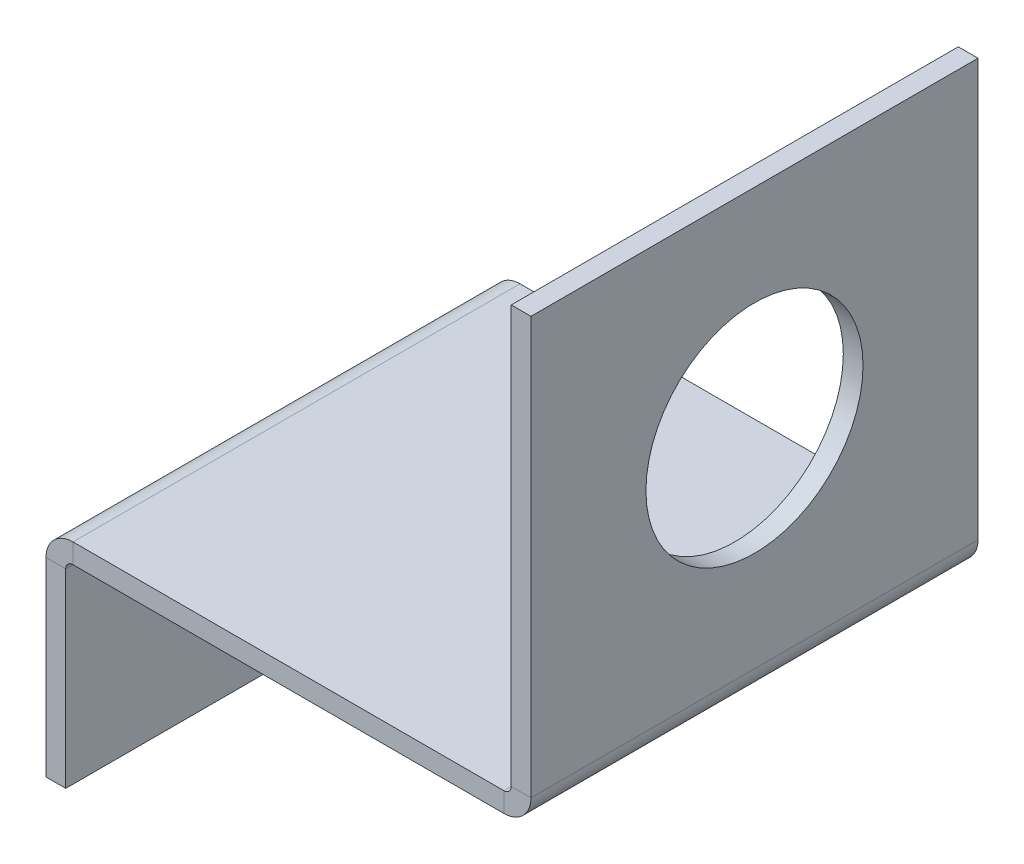
ISO-10303-21;
HEADER;
FILE_DESCRIPTION(('STEP AP214'),'2;1');
FILE_NAME('part.step','',(''),(''),'','','');
FILE_SCHEMA(('AUTOMOTIVE_DESIGN { 1 0 10303 214 1 1 1 1 }'));
ENDSEC;
DATA;
#1=APPLICATION_CONTEXT('core data for automotive mechanical design processes');
#2=APPLICATION_PROTOCOL_DEFINITION('international standard','automotive_design',2000,#1);
#3=PRODUCT_CONTEXT('',#1,'mechanical');
#4=PRODUCT('Part','Part','',(#3));
#5=PRODUCT_RELATED_PRODUCT_CATEGORY('part','',(#4));
#6=PRODUCT_DEFINITION_FORMATION('','',#4);
#7=PRODUCT_DEFINITION_CONTEXT('part definition',#1,'design');
#8=PRODUCT_DEFINITION('design','',#6,#7);
#9=PRODUCT_DEFINITION_SHAPE('','',#8);
#10=(LENGTH_UNIT() NAMED_UNIT(*) SI_UNIT(.MILLI.,.METRE.));
#11=(NAMED_UNIT(*) PLANE_ANGLE_UNIT() SI_UNIT($,.RADIAN.));
#12=(NAMED_UNIT(*) SI_UNIT($,.STERADIAN.) SOLID_ANGLE_UNIT());
#13=UNCERTAINTY_MEASURE_WITH_UNIT(LENGTH_MEASURE(1.E-05),#10,'distance_accuracy_value','');
#14=(GEOMETRIC_REPRESENTATION_CONTEXT(3) GLOBAL_UNCERTAINTY_ASSIGNED_CONTEXT((#13)) GLOBAL_UNIT_ASSIGNED_CONTEXT((#10,
#11,#12)) REPRESENTATION_CONTEXT('',''));
#15=CARTESIAN_POINT('',(0.,0.,0.));
#16=DIRECTION('',(0.,0.,1.));
#17=DIRECTION('',(1.,0.,0.));
#18=AXIS2_PLACEMENT_3D('',#15,#16,#17);
#19=CARTESIAN_POINT('',(0.,0.,-45.3));
#20=DIRECTION('',(0.,0.,1.));
#21=DIRECTION('',(1.,0.,0.));
#22=AXIS2_PLACEMENT_3D('',#19,#20,#21);
#23=PLANE('',#22);
#24=DIRECTION('',(0.,-1.,0.));
#25=VECTOR('',#24,1.);
#26=CARTESIAN_POINT('',(44.4071912642045,1.59594559789866E-13,-45.3));
#27=LINE('',#26,#25);
#28=CARTESIAN_POINT('',(44.4071912642045,1.59594559789866E-13,-45.3));
#29=VERTEX_POINT('',#28);
#30=CARTESIAN_POINT('',(44.4071912642045,-1.99999999999984,-45.3));
#31=VERTEX_POINT('',#30);
#32=EDGE_CURVE('E217',#29,#31,#27,.T.);
#33=ORIENTED_EDGE('',*,*,#32,.T.);
#34=DIRECTION('',(1.,0.,0.));
#35=VECTOR('',#34,1.);
#36=CARTESIAN_POINT('',(0.,-2.,-45.3));
#37=LINE('',#36,#35);
#38=CARTESIAN_POINT('',(0.736599999999997,-2.,-45.3));
#39=VERTEX_POINT('',#38);
#40=EDGE_CURVE('E242',#31,#39,#37,.F.);
#41=ORIENTED_EDGE('',*,*,#40,.T.);
#42=DIRECTION('',(0.,-1.,0.));
#43=VECTOR('',#42,1.);
#44=CARTESIAN_POINT('',(0.73659999999999,0.,-45.3));
#45=LINE('',#44,#43);
#46=CARTESIAN_POINT('',(0.73659999999999,0.,-45.3));
#47=VERTEX_POINT('',#46);
#48=EDGE_CURVE('E230',#39,#47,#45,.F.);
#49=ORIENTED_EDGE('',*,*,#48,.T.);
#50=DIRECTION('',(-1.,0.,0.));
#51=VECTOR('',#50,1.);
#52=CARTESIAN_POINT('',(0.,0.,-45.3));
#53=LINE('',#52,#51);
#54=EDGE_CURVE('E237',#29,#47,#53,.T.);
#55=ORIENTED_EDGE('',*,*,#54,.F.);
#56=EDGE_LOOP('',(#33,#41,#49,#55));
#57=FACE_BOUND('',#56,.T.);
#58=ADVANCED_FACE('F79',(#57),#23,.F.);
#59=CARTESIAN_POINT('',(47.1437912642045,1.64798730217797E-13,0.));
#60=DIRECTION('',(0.,0.,-1.));
#61=DIRECTION('',(-1.,0.,0.));
#62=AXIS2_PLACEMENT_3D('',#59,#60,#61);
#63=PLANE('',#62);
#64=DIRECTION('',(0.,-1.,0.));
#65=VECTOR('',#64,1.);
#66=CARTESIAN_POINT('',(44.4071912642045,1.59594559789866E-13,0.));
#67=LINE('',#66,#65);
#68=CARTESIAN_POINT('',(44.4071912642045,1.59594559789866E-13,0.));
#69=VERTEX_POINT('',#68);
#70=CARTESIAN_POINT('',(44.4071912642045,-1.99999999999984,0.));
#71=VERTEX_POINT('',#70);
#72=EDGE_CURVE('E228',#69,#71,#67,.T.);
#73=ORIENTED_EDGE('',*,*,#72,.F.);
#74=DIRECTION('',(1.,0.,0.));
#75=VECTOR('',#74,1.);
#76=CARTESIAN_POINT('',(0.,0.,0.));
#77=LINE('',#76,#75);
#78=CARTESIAN_POINT('',(0.73659999999999,0.,0.));
#79=VERTEX_POINT('',#78);
#80=EDGE_CURVE('E233',#79,#69,#77,.T.);
#81=ORIENTED_EDGE('',*,*,#80,.F.);
#82=DIRECTION('',(0.,-1.,0.));
#83=VECTOR('',#82,1.);
#84=CARTESIAN_POINT('',(0.736599999999997,-2.,0.));
#85=LINE('',#84,#83);
#86=CARTESIAN_POINT('',(0.736599999999997,-2.,0.));
#87=VERTEX_POINT('',#86);
#88=EDGE_CURVE('E247',#87,#79,#85,.F.);
#89=ORIENTED_EDGE('',*,*,#88,.F.);
#90=DIRECTION('',(-1.,0.,0.));
#91=VECTOR('',#90,1.);
#92=CARTESIAN_POINT('',(47.1437912642045,-1.99999999999984,0.));
#93=LINE('',#92,#91);
#94=EDGE_CURVE('E239',#87,#71,#93,.F.);
#95=ORIENTED_EDGE('',*,*,#94,.T.);
#96=EDGE_LOOP('',(#73,#81,#89,#95));
#97=FACE_BOUND('',#96,.T.);
#98=ADVANCED_FACE('F321',(#97),#63,.F.);
#99=CARTESIAN_POINT('',(0.,0.,0.));
#100=DIRECTION('',(0.,-1.,0.));
#101=DIRECTION('',(1.,0.,0.));
#102=AXIS2_PLACEMENT_3D('',#99,#100,#101);
#103=PLANE('',#102);
#104=DIRECTION('',(0.,0.,-1.));
#105=VECTOR('',#104,1.);
#106=CARTESIAN_POINT('',(44.4071912642045,1.59594559789866E-13,-45.3));
#107=LINE('',#106,#105);
#108=EDGE_CURVE('E223',#29,#69,#107,.F.);
#109=ORIENTED_EDGE('',*,*,#108,.F.);
#110=ORIENTED_EDGE('',*,*,#54,.T.);
#111=DIRECTION('',(0.,0.,1.));
#112=VECTOR('',#111,1.);
#113=CARTESIAN_POINT('',(0.73659999999999,0.,-45.3));
#114=LINE('',#113,#112);
#115=EDGE_CURVE('E244',#79,#47,#114,.F.);
#116=ORIENTED_EDGE('',*,*,#115,.F.);
#117=ORIENTED_EDGE('',*,*,#80,.T.);
#118=EDGE_LOOP('',(#109,#110,#116,#117));
#119=FACE_BOUND('',#118,.T.);
#120=ADVANCED_FACE('F324',(#119),#103,.F.);
#121=CARTESIAN_POINT('',(0.,-2.,0.));
#122=DIRECTION('',(0.,-1.,0.));
#123=DIRECTION('',(1.,0.,0.));
#124=AXIS2_PLACEMENT_3D('',#121,#122,#123);
#125=PLANE('',#124);
#126=ORIENTED_EDGE('',*,*,#40,.F.);
#127=DIRECTION('',(0.,0.,-1.));
#128=VECTOR('',#127,1.);
#129=CARTESIAN_POINT('',(44.4071912642045,-1.99999999999984,-45.3));
#130=LINE('',#129,#128);
#131=EDGE_CURVE('E212',#31,#71,#130,.F.);
#132=ORIENTED_EDGE('',*,*,#131,.T.);
#133=ORIENTED_EDGE('',*,*,#94,.F.);
#134=DIRECTION('',(0.,0.,1.));
#135=VECTOR('',#134,1.);
#136=CARTESIAN_POINT('',(0.736599999999997,-2.,-45.3));
#137=LINE('',#136,#135);
#138=EDGE_CURVE('E250',#39,#87,#137,.T.);
#139=ORIENTED_EDGE('',*,*,#138,.F.);
#140=EDGE_LOOP('',(#126,#132,#133,#139));
#141=FACE_BOUND('',#140,.T.);
#142=ADVANCED_FACE('F312',(#141),#125,.T.);
#143=CARTESIAN_POINT('',(-2.,0.,0.));
#144=DIRECTION('',(0.,0.,1.));
#145=DIRECTION('',(0.,-1.,0.));
#146=AXIS2_PLACEMENT_3D('',#143,#144,#145);
#147=PLANE('',#146);
#148=DIRECTION('',(0.,-1.,0.));
#149=VECTOR('',#148,1.);
#150=CARTESIAN_POINT('',(0.,0.,0.));
#151=LINE('',#150,#149);
#152=CARTESIAN_POINT('',(0.,-2.7366,0.));
#153=VERTEX_POINT('',#152);
#154=CARTESIAN_POINT('',(0.,-22.,0.));
#155=VERTEX_POINT('',#154);
#156=EDGE_CURVE('E272',#153,#155,#151,.T.);
#157=ORIENTED_EDGE('',*,*,#156,.F.);
#158=DIRECTION('',(-1.,0.,0.));
#159=VECTOR('',#158,1.);
#160=CARTESIAN_POINT('',(0.,-2.7366,0.));
#161=LINE('',#160,#159);
#162=CARTESIAN_POINT('',(-2.,-2.7366,0.));
#163=VERTEX_POINT('',#162);
#164=EDGE_CURVE('E260',#153,#163,#161,.T.);
#165=ORIENTED_EDGE('',*,*,#164,.T.);
#166=DIRECTION('',(0.,-1.,0.));
#167=VECTOR('',#166,1.);
#168=CARTESIAN_POINT('',(-2.,0.,0.));
#169=LINE('',#168,#167);
#170=CARTESIAN_POINT('',(-2.,-22.,0.));
#171=VERTEX_POINT('',#170);
#172=EDGE_CURVE('E275',#163,#171,#169,.T.);
#173=ORIENTED_EDGE('',*,*,#172,.T.);
#174=DIRECTION('',(1.,0.,0.));
#175=VECTOR('',#174,1.);
#176=CARTESIAN_POINT('',(-2.,-22.,0.));
#177=LINE('',#176,#175);
#178=EDGE_CURVE('E88',#171,#155,#177,.T.);
#179=ORIENTED_EDGE('',*,*,#178,.T.);
#180=EDGE_LOOP('',(#157,#165,#173,#179));
#181=FACE_BOUND('',#180,.T.);
#182=ADVANCED_FACE('F81',(#181),#147,.T.);
#183=CARTESIAN_POINT('',(-2.,0.,0.));
#184=DIRECTION('',(1.,0.,0.));
#185=DIRECTION('',(0.,0.,-1.));
#186=AXIS2_PLACEMENT_3D('',#183,#184,#185);
#187=PLANE('',#186);
#188=DIRECTION('',(0.,0.,1.));
#189=VECTOR('',#188,1.);
#190=CARTESIAN_POINT('',(-2.,-2.7366,0.));
#191=LINE('',#190,#189);
#192=CARTESIAN_POINT('',(-2.,-2.7366,-45.3));
#193=VERTEX_POINT('',#192);
#194=EDGE_CURVE('E254',#163,#193,#191,.F.);
#195=ORIENTED_EDGE('',*,*,#194,.T.);
#196=DIRECTION('',(0.,1.,0.));
#197=VECTOR('',#196,1.);
#198=CARTESIAN_POINT('',(-2.,0.,-45.3));
#199=LINE('',#198,#197);
#200=CARTESIAN_POINT('',(-2.,-22.,-45.3));
#201=VERTEX_POINT('',#200);
#202=EDGE_CURVE('E281',#201,#193,#199,.T.);
#203=ORIENTED_EDGE('',*,*,#202,.F.);
#204=DIRECTION('',(0.,0.,-1.));
#205=VECTOR('',#204,1.);
#206=CARTESIAN_POINT('',(-2.,-22.,0.));
#207=LINE('',#206,#205);
#208=EDGE_CURVE('E277',#171,#201,#207,.T.);
#209=ORIENTED_EDGE('',*,*,#208,.F.);
#210=ORIENTED_EDGE('',*,*,#172,.F.);
#211=EDGE_LOOP('',(#195,#203,#209,#210));
#212=FACE_BOUND('',#211,.T.);
#213=ADVANCED_FACE('F330',(#212),#187,.F.);
#214=CARTESIAN_POINT('',(0.,0.,0.));
#215=DIRECTION('',(1.,0.,0.));
#216=DIRECTION('',(0.,0.,-1.));
#217=AXIS2_PLACEMENT_3D('',#214,#215,#216);
#218=PLANE('',#217);
#219=DIRECTION('',(0.,1.,0.));
#220=VECTOR('',#219,1.);
#221=CARTESIAN_POINT('',(0.,0.,-45.3));
#222=LINE('',#221,#220);
#223=CARTESIAN_POINT('',(0.,-22.,-45.3));
#224=VERTEX_POINT('',#223);
#225=CARTESIAN_POINT('',(0.,-2.7366,-45.3));
#226=VERTEX_POINT('',#225);
#227=EDGE_CURVE('E278',#224,#226,#222,.T.);
#228=ORIENTED_EDGE('',*,*,#227,.T.);
#229=DIRECTION('',(0.,0.,1.));
#230=VECTOR('',#229,1.);
#231=CARTESIAN_POINT('',(0.,-2.7366,0.));
#232=LINE('',#231,#230);
#233=EDGE_CURVE('E104',#153,#226,#232,.F.);
#234=ORIENTED_EDGE('',*,*,#233,.F.);
#235=ORIENTED_EDGE('',*,*,#156,.T.);
#236=DIRECTION('',(0.,0.,-1.));
#237=VECTOR('',#236,1.);
#238=CARTESIAN_POINT('',(0.,-22.,0.));
#239=LINE('',#238,#237);
#240=EDGE_CURVE('E285',#155,#224,#239,.T.);
#241=ORIENTED_EDGE('',*,*,#240,.T.);
#242=EDGE_LOOP('',(#228,#234,#235,#241));
#243=FACE_BOUND('',#242,.T.);
#244=ADVANCED_FACE('F297',(#243),#218,.T.);
#245=CARTESIAN_POINT('',(-2.,0.,-45.3));
#246=DIRECTION('',(0.,0.,-1.));
#247=DIRECTION('',(-1.,0.,0.));
#248=AXIS2_PLACEMENT_3D('',#245,#246,#247);
#249=PLANE('',#248);
#250=DIRECTION('',(-1.,0.,0.));
#251=VECTOR('',#250,1.);
#252=CARTESIAN_POINT('',(0.,-2.7366,-45.3));
#253=LINE('',#252,#251);
#254=EDGE_CURVE('E269',#226,#193,#253,.T.);
#255=ORIENTED_EDGE('',*,*,#254,.F.);
#256=ORIENTED_EDGE('',*,*,#227,.F.);
#257=DIRECTION('',(1.,0.,0.));
#258=VECTOR('',#257,1.);
#259=CARTESIAN_POINT('',(-2.,-22.,-45.3));
#260=LINE('',#259,#258);
#261=EDGE_CURVE('E13',#201,#224,#260,.T.);
#262=ORIENTED_EDGE('',*,*,#261,.F.);
#263=ORIENTED_EDGE('',*,*,#202,.T.);
#264=EDGE_LOOP('',(#255,#256,#262,#263));
#265=FACE_BOUND('',#264,.T.);
#266=ADVANCED_FACE('F331',(#265),#249,.T.);
#267=CARTESIAN_POINT('',(-2.,-22.,0.));
#268=DIRECTION('',(0.,-1.,0.));
#269=DIRECTION('',(0.,0.,-1.));
#270=AXIS2_PLACEMENT_3D('',#267,#268,#269);
#271=PLANE('',#270);
#272=ORIENTED_EDGE('',*,*,#240,.F.);
#273=ORIENTED_EDGE('',*,*,#178,.F.);
#274=ORIENTED_EDGE('',*,*,#208,.T.);
#275=ORIENTED_EDGE('',*,*,#261,.T.);
#276=EDGE_LOOP('',(#272,#273,#274,#275));
#277=FACE_BOUND('',#276,.T.);
#278=ADVANCED_FACE('F295',(#277),#271,.T.);
#279=CARTESIAN_POINT('',(0.7366,-2.7366,-45.3));
#280=DIRECTION('',(0.,0.,-1.));
#281=DIRECTION('',(-1.,0.,0.));
#282=AXIS2_PLACEMENT_3D('',#279,#280,#281);
#283=PLANE('',#282);
#284=ORIENTED_EDGE('',*,*,#48,.F.);
#285=CARTESIAN_POINT('',(0.7366,-2.7366,-45.3));
#286=DIRECTION('',(0.,0.,1.));
#287=DIRECTION('',(1.,0.,0.));
#288=AXIS2_PLACEMENT_3D('',#285,#286,#287);
#289=CIRCLE('',#288,0.7366);
#290=EDGE_CURVE('E263',#226,#39,#289,.F.);
#291=ORIENTED_EDGE('',*,*,#290,.F.);
#292=ORIENTED_EDGE('',*,*,#254,.T.);
#293=CARTESIAN_POINT('',(0.7366,-2.7366,-45.3));
#294=DIRECTION('',(0.,0.,1.));
#295=DIRECTION('',(1.,0.,0.));
#296=AXIS2_PLACEMENT_3D('',#293,#294,#295);
#297=CIRCLE('',#296,2.7366);
#298=EDGE_CURVE('E256',#193,#47,#297,.F.);
#299=ORIENTED_EDGE('',*,*,#298,.T.);
#300=EDGE_LOOP('',(#284,#291,#292,#299));
#301=FACE_BOUND('',#300,.T.);
#302=ADVANCED_FACE('F306',(#301),#283,.T.);
#303=CARTESIAN_POINT('',(0.7366,-2.7366,0.));
#304=DIRECTION('',(0.,0.,-1.));
#305=DIRECTION('',(-1.,0.,0.));
#306=AXIS2_PLACEMENT_3D('',#303,#304,#305);
#307=PLANE('',#306);
#308=CARTESIAN_POINT('',(0.7366,-2.7366,0.));
#309=DIRECTION('',(0.,0.,1.));
#310=DIRECTION('',(1.,0.,0.));
#311=AXIS2_PLACEMENT_3D('',#308,#309,#310);
#312=CIRCLE('',#311,0.7366);
#313=EDGE_CURVE('E236',#87,#153,#312,.T.);
#314=ORIENTED_EDGE('',*,*,#313,.F.);
#315=ORIENTED_EDGE('',*,*,#88,.T.);
#316=CARTESIAN_POINT('',(0.7366,-2.7366,0.));
#317=DIRECTION('',(0.,0.,1.));
#318=DIRECTION('',(1.,0.,0.));
#319=AXIS2_PLACEMENT_3D('',#316,#317,#318);
#320=CIRCLE('',#319,2.7366);
#321=EDGE_CURVE('E257',#79,#163,#320,.T.);
#322=ORIENTED_EDGE('',*,*,#321,.T.);
#323=ORIENTED_EDGE('',*,*,#164,.F.);
#324=EDGE_LOOP('',(#314,#315,#322,#323));
#325=FACE_BOUND('',#324,.T.);
#326=ADVANCED_FACE('F316',(#325),#307,.F.);
#327=CARTESIAN_POINT('',(0.7366,-2.7366,0.));
#328=DIRECTION('',(0.,0.,1.));
#329=DIRECTION('',(0.,1.,0.));
#330=AXIS2_PLACEMENT_3D('',#327,#328,#329);
#331=CYLINDRICAL_SURFACE('',#330,2.7366);
#332=ORIENTED_EDGE('',*,*,#194,.F.);
#333=ORIENTED_EDGE('',*,*,#321,.F.);
#334=ORIENTED_EDGE('',*,*,#115,.T.);
#335=ORIENTED_EDGE('',*,*,#298,.F.);
#336=EDGE_LOOP('',(#332,#333,#334,#335));
#337=FACE_BOUND('',#336,.T.);
#338=ADVANCED_FACE('F327',(#337),#331,.T.);
#339=CARTESIAN_POINT('',(0.7366,-2.7366,0.));
#340=DIRECTION('',(0.,0.,1.));
#341=DIRECTION('',(0.,1.,0.));
#342=AXIS2_PLACEMENT_3D('',#339,#340,#341);
#343=CYLINDRICAL_SURFACE('',#342,0.7366);
#344=ORIENTED_EDGE('',*,*,#233,.T.);
#345=ORIENTED_EDGE('',*,*,#290,.T.);
#346=ORIENTED_EDGE('',*,*,#138,.T.);
#347=ORIENTED_EDGE('',*,*,#313,.T.);
#348=EDGE_LOOP('',(#344,#345,#346,#347));
#349=FACE_BOUND('',#348,.T.);
#350=ADVANCED_FACE('F301',(#349),#343,.F.);
#351=CARTESIAN_POINT('',(44.4071912642045,0.736600000000157,0.));
#352=DIRECTION('',(0.,0.,1.));
#353=DIRECTION('',(1.,0.,0.));
#354=AXIS2_PLACEMENT_3D('',#351,#352,#353);
#355=PLANE('',#354);
#356=DIRECTION('',(-1.,0.,0.));
#357=VECTOR('',#356,1.);
#358=CARTESIAN_POINT('',(47.1437912642045,0.736600000000157,0.));
#359=LINE('',#358,#357);
#360=CARTESIAN_POINT('',(45.1437912642045,0.736600000000157,0.));
#361=VERTEX_POINT('',#360);
#362=CARTESIAN_POINT('',(47.1437912642045,0.736600000000157,0.));
#363=VERTEX_POINT('',#362);
#364=EDGE_CURVE('E194',#361,#363,#359,.F.);
#365=ORIENTED_EDGE('',*,*,#364,.F.);
#366=CARTESIAN_POINT('',(44.4071912642045,0.736600000000157,0.));
#367=DIRECTION('',(0.,0.,-1.));
#368=DIRECTION('',(-1.,0.,0.));
#369=AXIS2_PLACEMENT_3D('',#366,#367,#368);
#370=CIRCLE('',#369,0.736599999999997);
#371=EDGE_CURVE('E220',#69,#361,#370,.F.);
#372=ORIENTED_EDGE('',*,*,#371,.F.);
#373=ORIENTED_EDGE('',*,*,#72,.T.);
#374=CARTESIAN_POINT('',(44.4071912642045,0.736600000000157,0.));
#375=DIRECTION('',(0.,0.,-1.));
#376=DIRECTION('',(-1.,0.,0.));
#377=AXIS2_PLACEMENT_3D('',#374,#375,#376);
#378=CIRCLE('',#377,2.7366);
#379=EDGE_CURVE('E96',#71,#363,#378,.F.);
#380=ORIENTED_EDGE('',*,*,#379,.T.);
#381=EDGE_LOOP('',(#365,#372,#373,#380));
#382=FACE_BOUND('',#381,.T.);
#383=ADVANCED_FACE('F351',(#382),#355,.T.);
#384=CARTESIAN_POINT('',(44.4071912642045,0.736600000000157,-45.3));
#385=DIRECTION('',(0.,0.,1.));
#386=DIRECTION('',(1.,0.,0.));
#387=AXIS2_PLACEMENT_3D('',#384,#385,#386);
#388=PLANE('',#387);
#389=CARTESIAN_POINT('',(44.4071912642045,0.736600000000157,-45.3));
#390=DIRECTION('',(0.,0.,-1.));
#391=DIRECTION('',(-1.,0.,0.));
#392=AXIS2_PLACEMENT_3D('',#389,#390,#391);
#393=CIRCLE('',#392,0.736599999999997);
#394=CARTESIAN_POINT('',(45.1437912642045,0.736600000000157,-45.3));
#395=VERTEX_POINT('',#394);
#396=EDGE_CURVE('E225',#395,#29,#393,.T.);
#397=ORIENTED_EDGE('',*,*,#396,.F.);
#398=DIRECTION('',(-1.,0.,0.));
#399=VECTOR('',#398,1.);
#400=CARTESIAN_POINT('',(45.1437912642045,0.736600000000157,-45.3));
#401=LINE('',#400,#399);
#402=CARTESIAN_POINT('',(47.1437912642045,0.736600000000157,-45.3));
#403=VERTEX_POINT('',#402);
#404=EDGE_CURVE('E206',#395,#403,#401,.F.);
#405=ORIENTED_EDGE('',*,*,#404,.T.);
#406=CARTESIAN_POINT('',(44.4071912642045,0.736600000000157,-45.3));
#407=DIRECTION('',(0.,0.,-1.));
#408=DIRECTION('',(-1.,0.,0.));
#409=AXIS2_PLACEMENT_3D('',#406,#407,#408);
#410=CIRCLE('',#409,2.7366);
#411=EDGE_CURVE('E215',#403,#31,#410,.T.);
#412=ORIENTED_EDGE('',*,*,#411,.T.);
#413=ORIENTED_EDGE('',*,*,#32,.F.);
#414=EDGE_LOOP('',(#397,#405,#412,#413));
#415=FACE_BOUND('',#414,.T.);
#416=ADVANCED_FACE('F368',(#415),#388,.F.);
#417=CARTESIAN_POINT('',(44.4071912642045,0.736600000000157,-45.3));
#418=DIRECTION('',(0.,0.,-1.));
#419=DIRECTION('',(1.,0.,0.));
#420=AXIS2_PLACEMENT_3D('',#417,#418,#419);
#421=CYLINDRICAL_SURFACE('',#420,2.7366);
#422=ORIENTED_EDGE('',*,*,#131,.F.);
#423=ORIENTED_EDGE('',*,*,#411,.F.);
#424=DIRECTION('',(0.,0.,-1.));
#425=VECTOR('',#424,1.);
#426=CARTESIAN_POINT('',(47.1437912642045,0.736600000000157,0.));
#427=LINE('',#426,#425);
#428=EDGE_CURVE('E204',#403,#363,#427,.F.);
#429=ORIENTED_EDGE('',*,*,#428,.T.);
#430=ORIENTED_EDGE('',*,*,#379,.F.);
#431=EDGE_LOOP('',(#422,#423,#429,#430));
#432=FACE_BOUND('',#431,.T.);
#433=ADVANCED_FACE('F371',(#432),#421,.T.);
#434=CARTESIAN_POINT('',(44.4071912642045,0.736600000000157,-45.3));
#435=DIRECTION('',(0.,0.,-1.));
#436=DIRECTION('',(1.,0.,0.));
#437=AXIS2_PLACEMENT_3D('',#434,#435,#436);
#438=CYLINDRICAL_SURFACE('',#437,0.736599999999997);
#439=ORIENTED_EDGE('',*,*,#108,.T.);
#440=ORIENTED_EDGE('',*,*,#371,.T.);
#441=DIRECTION('',(0.,0.,-1.));
#442=VECTOR('',#441,1.);
#443=CARTESIAN_POINT('',(45.1437912642045,0.736600000000157,0.));
#444=LINE('',#443,#442);
#445=EDGE_CURVE('E209',#361,#395,#444,.T.);
#446=ORIENTED_EDGE('',*,*,#445,.T.);
#447=ORIENTED_EDGE('',*,*,#396,.T.);
#448=EDGE_LOOP('',(#439,#440,#446,#447));
#449=FACE_BOUND('',#448,.T.);
#450=ADVANCED_FACE('F376',(#449),#438,.F.);
#451=CARTESIAN_POINT('',(47.1437912642045,43.0000000000002,-45.3));
#452=DIRECTION('',(0.,0.,1.));
#453=DIRECTION('',(0.,-1.,0.));
#454=AXIS2_PLACEMENT_3D('',#451,#452,#453);
#455=PLANE('',#454);
#456=ORIENTED_EDGE('',*,*,#404,.F.);
#457=DIRECTION('',(0.,-1.,0.));
#458=VECTOR('',#457,1.);
#459=CARTESIAN_POINT('',(45.1437912642045,43.0000000000002,-45.3));
#460=LINE('',#459,#458);
#461=CARTESIAN_POINT('',(45.1437912642045,43.0000000000002,-45.3));
#462=VERTEX_POINT('',#461);
#463=EDGE_CURVE('E202',#395,#462,#460,.F.);
#464=ORIENTED_EDGE('',*,*,#463,.T.);
#465=DIRECTION('',(-1.,0.,0.));
#466=VECTOR('',#465,1.);
#467=CARTESIAN_POINT('',(47.1437912642045,43.0000000000002,-45.3));
#468=LINE('',#467,#466);
#469=CARTESIAN_POINT('',(47.1437912642045,43.0000000000002,-45.3));
#470=VERTEX_POINT('',#469);
#471=EDGE_CURVE('E190',#470,#462,#468,.T.);
#472=ORIENTED_EDGE('',*,*,#471,.F.);
#473=DIRECTION('',(0.,1.,0.));
#474=VECTOR('',#473,1.);
#475=CARTESIAN_POINT('',(47.1437912642045,0.,-45.3));
#476=LINE('',#475,#474);
#477=EDGE_CURVE('E177',#403,#470,#476,.T.);
#478=ORIENTED_EDGE('',*,*,#477,.F.);
#479=EDGE_LOOP('',(#456,#464,#472,#478));
#480=FACE_BOUND('',#479,.T.);
#481=ADVANCED_FACE('F379',(#480),#455,.F.);
#482=CARTESIAN_POINT('',(47.1437912642045,1.576187047636E-13,0.));
#483=DIRECTION('',(0.,0.,-1.));
#484=DIRECTION('',(-1.,0.,0.));
#485=AXIS2_PLACEMENT_3D('',#482,#483,#484);
#486=PLANE('',#485);
#487=ORIENTED_EDGE('',*,*,#364,.T.);
#488=DIRECTION('',(0.,-1.,0.));
#489=VECTOR('',#488,1.);
#490=CARTESIAN_POINT('',(47.1437912642045,0.,0.));
#491=LINE('',#490,#489);
#492=CARTESIAN_POINT('',(47.1437912642045,43.0000000000002,0.));
#493=VERTEX_POINT('',#492);
#494=EDGE_CURVE('E175',#493,#363,#491,.T.);
#495=ORIENTED_EDGE('',*,*,#494,.F.);
#496=DIRECTION('',(-1.,0.,0.));
#497=VECTOR('',#496,1.);
#498=CARTESIAN_POINT('',(47.1437912642045,43.0000000000002,0.));
#499=LINE('',#498,#497);
#500=CARTESIAN_POINT('',(45.1437912642045,43.0000000000002,0.));
#501=VERTEX_POINT('',#500);
#502=EDGE_CURVE('E183',#493,#501,#499,.T.);
#503=ORIENTED_EDGE('',*,*,#502,.T.);
#504=DIRECTION('',(0.,1.,0.));
#505=VECTOR('',#504,1.);
#506=CARTESIAN_POINT('',(45.1437912642045,1.576187047636E-13,0.));
#507=LINE('',#506,#505);
#508=EDGE_CURVE('E199',#501,#361,#507,.F.);
#509=ORIENTED_EDGE('',*,*,#508,.T.);
#510=EDGE_LOOP('',(#487,#495,#503,#509));
#511=FACE_BOUND('',#510,.T.);
#512=ADVANCED_FACE('F193',(#511),#486,.F.);
#513=CARTESIAN_POINT('',(47.1437912642045,0.,0.));
#514=DIRECTION('',(-1.,0.,0.));
#515=DIRECTION('',(0.,0.,1.));
#516=AXIS2_PLACEMENT_3D('',#513,#514,#515);
#517=PLANE('',#516);
#518=CARTESIAN_POINT('',(47.1437912642045,21.8683000000002,-22.65));
#519=DIRECTION('',(1.,0.,0.));
#520=DIRECTION('',(0.,0.,-1.));
#521=AXIS2_PLACEMENT_3D('',#518,#519,#520);
#522=CIRCLE('',#521,11.);
#523=CARTESIAN_POINT('',(47.1437912642045,21.8683000000002,-33.65));
#524=VERTEX_POINT('',#523);
#525=EDGE_CURVE('E407',#524,#524,#522,.T.);
#526=ORIENTED_EDGE('',*,*,#525,.F.);
#527=EDGE_LOOP('',(#526));
#528=FACE_BOUND('',#527,.T.);
#529=ORIENTED_EDGE('',*,*,#428,.F.);
#530=ORIENTED_EDGE('',*,*,#477,.T.);
#531=DIRECTION('',(0.,0.,1.));
#532=VECTOR('',#531,1.);
#533=CARTESIAN_POINT('',(47.1437912642045,43.0000000000002,0.));
#534=LINE('',#533,#532);
#535=EDGE_CURVE('E170',#470,#493,#534,.T.);
#536=ORIENTED_EDGE('',*,*,#535,.T.);
#537=ORIENTED_EDGE('',*,*,#494,.T.);
#538=EDGE_LOOP('',(#529,#530,#536,#537));
#539=FACE_BOUND('',#538,.T.);
#540=ADVANCED_FACE('F173',(#528,#539),#517,.F.);
#541=CARTESIAN_POINT('',(45.1437912642045,0.,0.));
#542=DIRECTION('',(-1.,0.,0.));
#543=DIRECTION('',(0.,0.,1.));
#544=AXIS2_PLACEMENT_3D('',#541,#542,#543);
#545=PLANE('',#544);
#546=CARTESIAN_POINT('',(45.1437912642045,21.8683000000002,-22.65));
#547=DIRECTION('',(-1.,0.,0.));
#548=DIRECTION('',(0.,0.,1.));
#549=AXIS2_PLACEMENT_3D('',#546,#547,#548);
#550=CIRCLE('',#549,11.);
#551=CARTESIAN_POINT('',(45.1437912642045,21.8683000000002,-11.65));
#552=VERTEX_POINT('',#551);
#553=EDGE_CURVE('E83',#552,#552,#550,.T.);
#554=ORIENTED_EDGE('',*,*,#553,.F.);
#555=EDGE_LOOP('',(#554));
#556=FACE_BOUND('',#555,.T.);
#557=ORIENTED_EDGE('',*,*,#463,.F.);
#558=ORIENTED_EDGE('',*,*,#445,.F.);
#559=ORIENTED_EDGE('',*,*,#508,.F.);
#560=DIRECTION('',(0.,0.,-1.));
#561=VECTOR('',#560,1.);
#562=CARTESIAN_POINT('',(45.1437912642045,43.0000000000002,0.));
#563=LINE('',#562,#561);
#564=EDGE_CURVE('E186',#462,#501,#563,.F.);
#565=ORIENTED_EDGE('',*,*,#564,.F.);
#566=EDGE_LOOP('',(#557,#558,#559,#565));
#567=FACE_BOUND('',#566,.T.);
#568=ADVANCED_FACE('F389',(#556,#567),#545,.T.);
#569=CARTESIAN_POINT('',(47.1437912642045,43.0000000000002,0.));
#570=DIRECTION('',(0.,-1.,0.));
#571=DIRECTION('',(0.,0.,-1.));
#572=AXIS2_PLACEMENT_3D('',#569,#570,#571);
#573=PLANE('',#572);
#574=ORIENTED_EDGE('',*,*,#564,.T.);
#575=ORIENTED_EDGE('',*,*,#502,.F.);
#576=ORIENTED_EDGE('',*,*,#535,.F.);
#577=ORIENTED_EDGE('',*,*,#471,.T.);
#578=EDGE_LOOP('',(#574,#575,#576,#577));
#579=FACE_BOUND('',#578,.T.);
#580=ADVANCED_FACE('F184',(#579),#573,.F.);
#581=CARTESIAN_POINT('',(37.1437912642045,21.8683000000002,-22.65));
#582=DIRECTION('',(1.,0.,0.));
#583=DIRECTION('',(0.,0.,-1.));
#584=AXIS2_PLACEMENT_3D('',#581,#582,#583);
#585=CYLINDRICAL_SURFACE('',#584,11.);
#586=ORIENTED_EDGE('',*,*,#553,.T.);
#587=EDGE_LOOP('',(#586));
#588=FACE_BOUND('',#587,.T.);
#589=ORIENTED_EDGE('',*,*,#525,.T.);
#590=EDGE_LOOP('',(#589));
#591=FACE_BOUND('',#590,.T.);
#592=ADVANCED_FACE('F388',(#588,#591),#585,.F.);
#593=CLOSED_SHELL('',(#58,#98,#120,#142,#182,#213,#244,#266,#278,#302,#326,#338,#350,#383,#416,
#433,#450,#481,#512,#540,#568,#580,#592));
#594=MANIFOLD_SOLID_BREP('B2',#593);
#595=ADVANCED_BREP_SHAPE_REPRESENTATION('',(#18,#594),#14);
#596=SHAPE_DEFINITION_REPRESENTATION(#9,#595);
ENDSEC;
END-ISO-10303-21;
